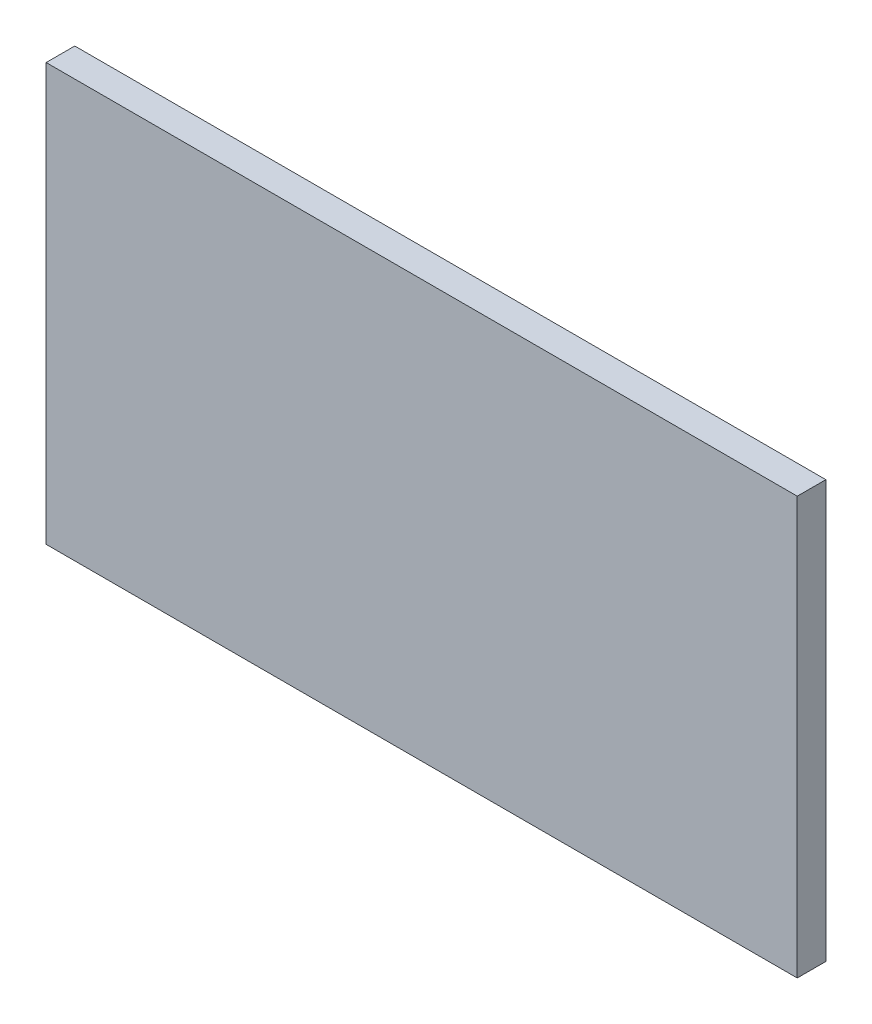
ISO-10303-21;
HEADER;
FILE_DESCRIPTION(('STEP AP214'),'2;1');
FILE_NAME('part.step','',(''),(''),'','','');
FILE_SCHEMA(('AUTOMOTIVE_DESIGN { 1 0 10303 214 1 1 1 1 }'));
ENDSEC;
DATA;
#1=APPLICATION_CONTEXT('core data for automotive mechanical design processes');
#2=APPLICATION_PROTOCOL_DEFINITION('international standard','automotive_design',2000,#1);
#3=PRODUCT_CONTEXT('',#1,'mechanical');
#4=PRODUCT('Part','Part','',(#3));
#5=PRODUCT_RELATED_PRODUCT_CATEGORY('part','',(#4));
#6=PRODUCT_DEFINITION_FORMATION('','',#4);
#7=PRODUCT_DEFINITION_CONTEXT('part definition',#1,'design');
#8=PRODUCT_DEFINITION('design','',#6,#7);
#9=PRODUCT_DEFINITION_SHAPE('','',#8);
#10=(LENGTH_UNIT() NAMED_UNIT(*) SI_UNIT(.MILLI.,.METRE.));
#11=(NAMED_UNIT(*) PLANE_ANGLE_UNIT() SI_UNIT($,.RADIAN.));
#12=(NAMED_UNIT(*) SI_UNIT($,.STERADIAN.) SOLID_ANGLE_UNIT());
#13=UNCERTAINTY_MEASURE_WITH_UNIT(LENGTH_MEASURE(1.E-05),#10,'distance_accuracy_value','');
#14=(GEOMETRIC_REPRESENTATION_CONTEXT(3) GLOBAL_UNCERTAINTY_ASSIGNED_CONTEXT((#13)) GLOBAL_UNIT_ASSIGNED_CONTEXT((#10,
#11,#12)) REPRESENTATION_CONTEXT('',''));
#15=CARTESIAN_POINT('',(0.,0.,0.));
#16=DIRECTION('',(0.,0.,1.));
#17=DIRECTION('',(1.,0.,0.));
#18=AXIS2_PLACEMENT_3D('',#15,#16,#17);
#19=CARTESIAN_POINT('',(0.70008,4.,0.));
#20=DIRECTION('',(0.,0.,-1.));
#21=DIRECTION('',(-1.,0.,0.));
#22=AXIS2_PLACEMENT_3D('',#19,#20,#21);
#23=PLANE('',#22);
#24=DIRECTION('',(1.,0.,0.));
#25=VECTOR('',#24,1.);
#26=CARTESIAN_POINT('',(0.25008,4.25,0.));
#27=LINE('',#26,#25);
#28=CARTESIAN_POINT('',(0.25008,4.25,0.));
#29=VERTEX_POINT('',#28);
#30=CARTESIAN_POINT('',(1.15008,4.25,0.));
#31=VERTEX_POINT('',#30);
#32=EDGE_CURVE('E55',#29,#31,#27,.T.);
#33=ORIENTED_EDGE('',*,*,#32,.T.);
#34=DIRECTION('',(0.,1.,0.));
#35=VECTOR('',#34,1.);
#36=CARTESIAN_POINT('',(1.15008,4.25,0.));
#37=LINE('',#36,#35);
#38=CARTESIAN_POINT('',(1.15008,3.75,0.));
#39=VERTEX_POINT('',#38);
#40=EDGE_CURVE('E57',#31,#39,#37,.F.);
#41=ORIENTED_EDGE('',*,*,#40,.T.);
#42=DIRECTION('',(1.,0.,0.));
#43=VECTOR('',#42,1.);
#44=CARTESIAN_POINT('',(1.15008,3.75,0.));
#45=LINE('',#44,#43);
#46=CARTESIAN_POINT('',(0.25008,3.75,0.));
#47=VERTEX_POINT('',#46);
#48=EDGE_CURVE('E20',#39,#47,#45,.F.);
#49=ORIENTED_EDGE('',*,*,#48,.T.);
#50=DIRECTION('',(0.,1.,0.));
#51=VECTOR('',#50,1.);
#52=CARTESIAN_POINT('',(0.25008,3.75,0.));
#53=LINE('',#52,#51);
#54=EDGE_CURVE('E80',#47,#29,#53,.T.);
#55=ORIENTED_EDGE('',*,*,#54,.T.);
#56=EDGE_LOOP('',(#33,#41,#49,#55));
#57=FACE_BOUND('',#56,.T.);
#58=ADVANCED_FACE('F17',(#57),#23,.T.);
#59=CARTESIAN_POINT('',(1.15008,3.75,0.));
#60=DIRECTION('',(0.,1.,0.));
#61=DIRECTION('',(0.,0.,1.));
#62=AXIS2_PLACEMENT_3D('',#59,#60,#61);
#63=PLANE('',#62);
#64=DIRECTION('',(0.,0.,-1.));
#65=VECTOR('',#64,1.);
#66=CARTESIAN_POINT('',(0.25008,3.75,0.));
#67=LINE('',#66,#65);
#68=CARTESIAN_POINT('',(0.25008,3.75,0.03429));
#69=VERTEX_POINT('',#68);
#70=EDGE_CURVE('E68',#69,#47,#67,.T.);
#71=ORIENTED_EDGE('',*,*,#70,.T.);
#72=ORIENTED_EDGE('',*,*,#48,.F.);
#73=DIRECTION('',(0.,0.,1.));
#74=VECTOR('',#73,1.);
#75=CARTESIAN_POINT('',(1.15008,3.75,0.));
#76=LINE('',#75,#74);
#77=CARTESIAN_POINT('',(1.15008,3.75,0.03429));
#78=VERTEX_POINT('',#77);
#79=EDGE_CURVE('E63',#39,#78,#76,.T.);
#80=ORIENTED_EDGE('',*,*,#79,.T.);
#81=DIRECTION('',(1.,0.,0.));
#82=VECTOR('',#81,1.);
#83=CARTESIAN_POINT('',(0.70008,3.75,0.03429));
#84=LINE('',#83,#82);
#85=EDGE_CURVE('E83',#69,#78,#84,.T.);
#86=ORIENTED_EDGE('',*,*,#85,.F.);
#87=EDGE_LOOP('',(#71,#72,#80,#86));
#88=FACE_BOUND('',#87,.T.);
#89=ADVANCED_FACE('F65',(#88),#63,.F.);
#90=CARTESIAN_POINT('',(1.15008,4.25,0.));
#91=DIRECTION('',(-1.,0.,0.));
#92=DIRECTION('',(0.,0.,1.));
#93=AXIS2_PLACEMENT_3D('',#90,#91,#92);
#94=PLANE('',#93);
#95=ORIENTED_EDGE('',*,*,#79,.F.);
#96=ORIENTED_EDGE('',*,*,#40,.F.);
#97=DIRECTION('',(0.,0.,-1.));
#98=VECTOR('',#97,1.);
#99=CARTESIAN_POINT('',(1.15008,4.25,0.));
#100=LINE('',#99,#98);
#101=CARTESIAN_POINT('',(1.15008,4.25,0.03429));
#102=VERTEX_POINT('',#101);
#103=EDGE_CURVE('E75',#31,#102,#100,.F.);
#104=ORIENTED_EDGE('',*,*,#103,.T.);
#105=DIRECTION('',(0.,1.,0.));
#106=VECTOR('',#105,1.);
#107=CARTESIAN_POINT('',(1.15008,4.,0.03429));
#108=LINE('',#107,#106);
#109=EDGE_CURVE('E72',#78,#102,#108,.T.);
#110=ORIENTED_EDGE('',*,*,#109,.F.);
#111=EDGE_LOOP('',(#95,#96,#104,#110));
#112=FACE_BOUND('',#111,.T.);
#113=ADVANCED_FACE('F70',(#112),#94,.F.);
#114=CARTESIAN_POINT('',(0.25008,4.25,0.));
#115=DIRECTION('',(0.,-1.,0.));
#116=DIRECTION('',(0.,0.,-1.));
#117=AXIS2_PLACEMENT_3D('',#114,#115,#116);
#118=PLANE('',#117);
#119=ORIENTED_EDGE('',*,*,#103,.F.);
#120=ORIENTED_EDGE('',*,*,#32,.F.);
#121=DIRECTION('',(0.,0.,-1.));
#122=VECTOR('',#121,1.);
#123=CARTESIAN_POINT('',(0.25008,4.25,0.));
#124=LINE('',#123,#122);
#125=CARTESIAN_POINT('',(0.25008,4.25,0.03429));
#126=VERTEX_POINT('',#125);
#127=EDGE_CURVE('E35',#29,#126,#124,.F.);
#128=ORIENTED_EDGE('',*,*,#127,.T.);
#129=DIRECTION('',(1.,0.,0.));
#130=VECTOR('',#129,1.);
#131=CARTESIAN_POINT('',(0.70008,4.25,0.03429));
#132=LINE('',#131,#130);
#133=EDGE_CURVE('E26',#102,#126,#132,.F.);
#134=ORIENTED_EDGE('',*,*,#133,.F.);
#135=EDGE_LOOP('',(#119,#120,#128,#134));
#136=FACE_BOUND('',#135,.T.);
#137=ADVANCED_FACE('F89',(#136),#118,.F.);
#138=CARTESIAN_POINT('',(0.25008,3.75,0.));
#139=DIRECTION('',(1.,0.,0.));
#140=DIRECTION('',(0.,0.,-1.));
#141=AXIS2_PLACEMENT_3D('',#138,#139,#140);
#142=PLANE('',#141);
#143=ORIENTED_EDGE('',*,*,#127,.F.);
#144=ORIENTED_EDGE('',*,*,#54,.F.);
#145=ORIENTED_EDGE('',*,*,#70,.F.);
#146=DIRECTION('',(0.,1.,0.));
#147=VECTOR('',#146,1.);
#148=CARTESIAN_POINT('',(0.25008,4.,0.03429));
#149=LINE('',#148,#147);
#150=EDGE_CURVE('E11',#126,#69,#149,.F.);
#151=ORIENTED_EDGE('',*,*,#150,.F.);
#152=EDGE_LOOP('',(#143,#144,#145,#151));
#153=FACE_BOUND('',#152,.T.);
#154=ADVANCED_FACE('F91',(#153),#142,.F.);
#155=CARTESIAN_POINT('',(0.70008,4.,0.03429));
#156=DIRECTION('',(0.,0.,1.));
#157=DIRECTION('',(1.,0.,0.));
#158=AXIS2_PLACEMENT_3D('',#155,#156,#157);
#159=PLANE('',#158);
#160=ORIENTED_EDGE('',*,*,#133,.T.);
#161=ORIENTED_EDGE('',*,*,#150,.T.);
#162=ORIENTED_EDGE('',*,*,#85,.T.);
#163=ORIENTED_EDGE('',*,*,#109,.T.);
#164=EDGE_LOOP('',(#160,#161,#162,#163));
#165=FACE_BOUND('',#164,.T.);
#166=ADVANCED_FACE('F88',(#165),#159,.T.);
#167=CLOSED_SHELL('',(#58,#89,#113,#137,#154,#166));
#168=MANIFOLD_SOLID_BREP('B1',#167);
#169=ADVANCED_BREP_SHAPE_REPRESENTATION('',(#18,#168),#14);
#170=SHAPE_DEFINITION_REPRESENTATION(#9,#169);
ENDSEC;
END-ISO-10303-21;
